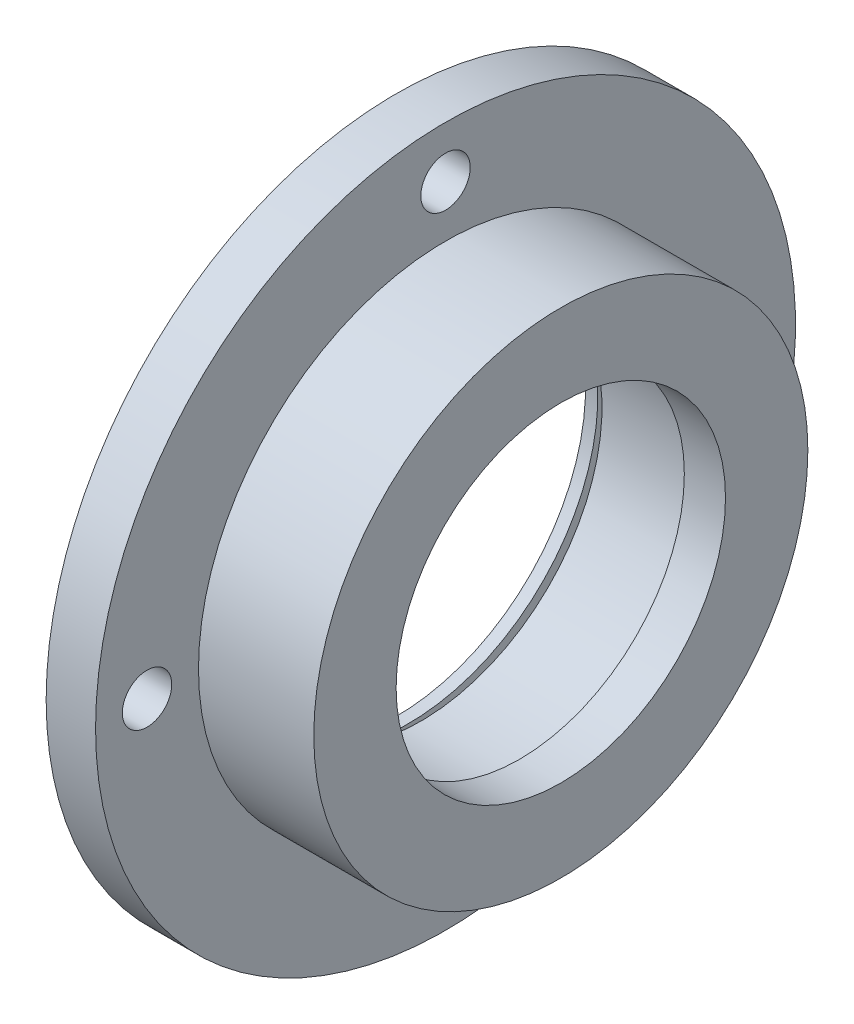
ISO-10303-21;
HEADER;
FILE_DESCRIPTION(('STEP AP214'),'2;1');
FILE_NAME('part.step','',(''),(''),'','','');
FILE_SCHEMA(('AUTOMOTIVE_DESIGN { 1 0 10303 214 1 1 1 1 }'));
ENDSEC;
DATA;
#1=APPLICATION_CONTEXT('core data for automotive mechanical design processes');
#2=APPLICATION_PROTOCOL_DEFINITION('international standard','automotive_design',2000,#1);
#3=PRODUCT_CONTEXT('',#1,'mechanical');
#4=PRODUCT('Part','Part','',(#3));
#5=PRODUCT_RELATED_PRODUCT_CATEGORY('part','',(#4));
#6=PRODUCT_DEFINITION_FORMATION('','',#4);
#7=PRODUCT_DEFINITION_CONTEXT('part definition',#1,'design');
#8=PRODUCT_DEFINITION('design','',#6,#7);
#9=PRODUCT_DEFINITION_SHAPE('','',#8);
#10=(LENGTH_UNIT() NAMED_UNIT(*) SI_UNIT(.MILLI.,.METRE.));
#11=(NAMED_UNIT(*) PLANE_ANGLE_UNIT() SI_UNIT($,.RADIAN.));
#12=(NAMED_UNIT(*) SI_UNIT($,.STERADIAN.) SOLID_ANGLE_UNIT());
#13=UNCERTAINTY_MEASURE_WITH_UNIT(LENGTH_MEASURE(1.E-05),#10,'distance_accuracy_value','');
#14=(GEOMETRIC_REPRESENTATION_CONTEXT(3) GLOBAL_UNCERTAINTY_ASSIGNED_CONTEXT((#13)) GLOBAL_UNIT_ASSIGNED_CONTEXT((#10,
#11,#12)) REPRESENTATION_CONTEXT('',''));
#15=CARTESIAN_POINT('',(0.,0.,0.));
#16=DIRECTION('',(0.,0.,1.));
#17=DIRECTION('',(1.,0.,0.));
#18=AXIS2_PLACEMENT_3D('',#15,#16,#17);
#19=CARTESIAN_POINT('',(0.,0.,0.));
#20=DIRECTION('',(-1.,0.,0.));
#21=DIRECTION('',(0.,0.,1.));
#22=AXIS2_PLACEMENT_3D('',#19,#20,#21);
#23=CYLINDRICAL_SURFACE('',#22,23.);
#24=CARTESIAN_POINT('',(1.49999999999999,0.,0.));
#25=DIRECTION('',(-1.,0.,0.));
#26=DIRECTION('',(0.,0.,1.));
#27=AXIS2_PLACEMENT_3D('',#24,#25,#26);
#28=CIRCLE('',#27,23.);
#29=CARTESIAN_POINT('',(1.49999999999999,0.,23.));
#30=VERTEX_POINT('',#29);
#31=EDGE_CURVE('E84',#30,#30,#28,.T.);
#32=ORIENTED_EDGE('',*,*,#31,.F.);
#33=EDGE_LOOP('',(#32));
#34=FACE_BOUND('',#33,.T.);
#35=CARTESIAN_POINT('',(0.,0.,0.));
#36=DIRECTION('',(-1.,0.,0.));
#37=DIRECTION('',(0.,0.,1.));
#38=AXIS2_PLACEMENT_3D('',#35,#36,#37);
#39=CIRCLE('',#38,23.);
#40=CARTESIAN_POINT('',(0.,0.,23.));
#41=VERTEX_POINT('',#40);
#42=EDGE_CURVE('E12',#41,#41,#39,.T.);
#43=ORIENTED_EDGE('',*,*,#42,.T.);
#44=EDGE_LOOP('',(#43));
#45=FACE_BOUND('',#44,.T.);
#46=ADVANCED_FACE('F44',(#34,#45),#23,.F.);
#47=CARTESIAN_POINT('',(0.,23.,0.));
#48=DIRECTION('',(1.,0.,0.));
#49=DIRECTION('',(0.,0.,-1.));
#50=AXIS2_PLACEMENT_3D('',#47,#48,#49);
#51=PLANE('',#50);
#52=CARTESIAN_POINT('',(0.,0.,36.25));
#53=DIRECTION('',(1.,0.,0.));
#54=DIRECTION('',(0.,0.,-1.));
#55=AXIS2_PLACEMENT_3D('',#52,#53,#54);
#56=CIRCLE('',#55,3.);
#57=CARTESIAN_POINT('',(0.,0.,33.25));
#58=VERTEX_POINT('',#57);
#59=EDGE_CURVE('E103',#58,#58,#56,.T.);
#60=ORIENTED_EDGE('',*,*,#59,.T.);
#61=EDGE_LOOP('',(#60));
#62=FACE_BOUND('',#61,.T.);
#63=CARTESIAN_POINT('',(0.,-36.25,0.));
#64=DIRECTION('',(1.,0.,0.));
#65=DIRECTION('',(0.,0.,-1.));
#66=AXIS2_PLACEMENT_3D('',#63,#64,#65);
#67=CIRCLE('',#66,3.);
#68=CARTESIAN_POINT('',(0.,-36.25,-3.00000000000002));
#69=VERTEX_POINT('',#68);
#70=EDGE_CURVE('E97',#69,#69,#67,.T.);
#71=ORIENTED_EDGE('',*,*,#70,.T.);
#72=EDGE_LOOP('',(#71));
#73=FACE_BOUND('',#72,.T.);
#74=CARTESIAN_POINT('',(0.,0.,-36.25));
#75=DIRECTION('',(1.,0.,0.));
#76=DIRECTION('',(0.,0.,-1.));
#77=AXIS2_PLACEMENT_3D('',#74,#75,#76);
#78=CIRCLE('',#77,3.00000000000015);
#79=CARTESIAN_POINT('',(0.,0.,-39.2500000000002));
#80=VERTEX_POINT('',#79);
#81=EDGE_CURVE('E91',#80,#80,#78,.T.);
#82=ORIENTED_EDGE('',*,*,#81,.T.);
#83=EDGE_LOOP('',(#82));
#84=FACE_BOUND('',#83,.T.);
#85=CARTESIAN_POINT('',(0.,36.25,0.));
#86=DIRECTION('',(1.,0.,0.));
#87=DIRECTION('',(0.,0.,-1.));
#88=AXIS2_PLACEMENT_3D('',#85,#86,#87);
#89=CIRCLE('',#88,3.);
#90=CARTESIAN_POINT('',(0.,36.25,-3.));
#91=VERTEX_POINT('',#90);
#92=EDGE_CURVE('E87',#91,#91,#89,.T.);
#93=ORIENTED_EDGE('',*,*,#92,.T.);
#94=EDGE_LOOP('',(#93));
#95=FACE_BOUND('',#94,.T.);
#96=ORIENTED_EDGE('',*,*,#42,.F.);
#97=EDGE_LOOP('',(#96));
#98=FACE_BOUND('',#97,.T.);
#99=CARTESIAN_POINT('',(0.,0.,0.));
#100=DIRECTION('',(-1.,0.,0.));
#101=DIRECTION('',(0.,0.,1.));
#102=AXIS2_PLACEMENT_3D('',#99,#100,#101);
#103=CIRCLE('',#102,42.5);
#104=CARTESIAN_POINT('',(0.,0.,42.5));
#105=VERTEX_POINT('',#104);
#106=EDGE_CURVE('E50',#105,#105,#103,.T.);
#107=ORIENTED_EDGE('',*,*,#106,.T.);
#108=EDGE_LOOP('',(#107));
#109=FACE_BOUND('',#108,.T.);
#110=ADVANCED_FACE('F112',(#62,#73,#84,#95,#98,#109),#51,.F.);
#111=CARTESIAN_POINT('',(0.,0.,0.));
#112=DIRECTION('',(-1.,0.,0.));
#113=DIRECTION('',(0.,0.,1.));
#114=AXIS2_PLACEMENT_3D('',#111,#112,#113);
#115=CYLINDRICAL_SURFACE('',#114,42.5);
#116=ORIENTED_EDGE('',*,*,#106,.F.);
#117=EDGE_LOOP('',(#116));
#118=FACE_BOUND('',#117,.T.);
#119=CARTESIAN_POINT('',(6.,0.,0.));
#120=DIRECTION('',(-1.,0.,0.));
#121=DIRECTION('',(0.,0.,1.));
#122=AXIS2_PLACEMENT_3D('',#119,#120,#121);
#123=CIRCLE('',#122,42.5);
#124=CARTESIAN_POINT('',(6.,0.,42.5));
#125=VERTEX_POINT('',#124);
#126=EDGE_CURVE('E54',#125,#125,#123,.T.);
#127=ORIENTED_EDGE('',*,*,#126,.T.);
#128=EDGE_LOOP('',(#127));
#129=FACE_BOUND('',#128,.T.);
#130=ADVANCED_FACE('F126',(#118,#129),#115,.T.);
#131=CARTESIAN_POINT('',(6.,42.5,0.));
#132=DIRECTION('',(-1.,0.,0.));
#133=DIRECTION('',(0.,0.,1.));
#134=AXIS2_PLACEMENT_3D('',#131,#132,#133);
#135=PLANE('',#134);
#136=CARTESIAN_POINT('',(6.,0.,36.25));
#137=DIRECTION('',(1.,0.,0.));
#138=DIRECTION('',(0.,0.,-1.));
#139=AXIS2_PLACEMENT_3D('',#136,#137,#138);
#140=CIRCLE('',#139,3.);
#141=CARTESIAN_POINT('',(6.,0.,33.25));
#142=VERTEX_POINT('',#141);
#143=EDGE_CURVE('E106',#142,#142,#140,.T.);
#144=ORIENTED_EDGE('',*,*,#143,.F.);
#145=EDGE_LOOP('',(#144));
#146=FACE_BOUND('',#145,.T.);
#147=CARTESIAN_POINT('',(6.,-36.25,0.));
#148=DIRECTION('',(1.,0.,0.));
#149=DIRECTION('',(0.,0.,-1.));
#150=AXIS2_PLACEMENT_3D('',#147,#148,#149);
#151=CIRCLE('',#150,3.);
#152=CARTESIAN_POINT('',(6.,-36.25,-3.00000000000002));
#153=VERTEX_POINT('',#152);
#154=EDGE_CURVE('E100',#153,#153,#151,.T.);
#155=ORIENTED_EDGE('',*,*,#154,.F.);
#156=EDGE_LOOP('',(#155));
#157=FACE_BOUND('',#156,.T.);
#158=CARTESIAN_POINT('',(6.,0.,-36.25));
#159=DIRECTION('',(1.,0.,0.));
#160=DIRECTION('',(0.,0.,-1.));
#161=AXIS2_PLACEMENT_3D('',#158,#159,#160);
#162=CIRCLE('',#161,3.00000000000015);
#163=CARTESIAN_POINT('',(6.,0.,-39.2500000000002));
#164=VERTEX_POINT('',#163);
#165=EDGE_CURVE('E94',#164,#164,#162,.T.);
#166=ORIENTED_EDGE('',*,*,#165,.F.);
#167=EDGE_LOOP('',(#166));
#168=FACE_BOUND('',#167,.T.);
#169=CARTESIAN_POINT('',(6.,36.25,0.));
#170=DIRECTION('',(1.,0.,0.));
#171=DIRECTION('',(0.,0.,-1.));
#172=AXIS2_PLACEMENT_3D('',#169,#170,#171);
#173=CIRCLE('',#172,3.);
#174=CARTESIAN_POINT('',(6.,36.25,-3.));
#175=VERTEX_POINT('',#174);
#176=EDGE_CURVE('E88',#175,#175,#173,.T.);
#177=ORIENTED_EDGE('',*,*,#176,.F.);
#178=EDGE_LOOP('',(#177));
#179=FACE_BOUND('',#178,.T.);
#180=ORIENTED_EDGE('',*,*,#126,.F.);
#181=EDGE_LOOP('',(#180));
#182=FACE_BOUND('',#181,.T.);
#183=CARTESIAN_POINT('',(5.99999999999999,0.,0.));
#184=DIRECTION('',(-1.,0.,0.));
#185=DIRECTION('',(0.,0.,1.));
#186=AXIS2_PLACEMENT_3D('',#183,#184,#185);
#187=CIRCLE('',#186,30.);
#188=CARTESIAN_POINT('',(5.99999999999999,0.,30.));
#189=VERTEX_POINT('',#188);
#190=EDGE_CURVE('E58',#189,#189,#187,.T.);
#191=ORIENTED_EDGE('',*,*,#190,.T.);
#192=EDGE_LOOP('',(#191));
#193=FACE_BOUND('',#192,.T.);
#194=ADVANCED_FACE('F122',(#146,#157,#168,#179,#182,#193),#135,.F.);
#195=CARTESIAN_POINT('',(0.,0.,0.));
#196=DIRECTION('',(-1.,0.,0.));
#197=DIRECTION('',(0.,0.,1.));
#198=AXIS2_PLACEMENT_3D('',#195,#196,#197);
#199=CYLINDRICAL_SURFACE('',#198,30.);
#200=ORIENTED_EDGE('',*,*,#190,.F.);
#201=EDGE_LOOP('',(#200));
#202=FACE_BOUND('',#201,.T.);
#203=CARTESIAN_POINT('',(20.,0.,0.));
#204=DIRECTION('',(-1.,0.,0.));
#205=DIRECTION('',(0.,0.,1.));
#206=AXIS2_PLACEMENT_3D('',#203,#204,#205);
#207=CIRCLE('',#206,30.);
#208=CARTESIAN_POINT('',(20.,0.,30.));
#209=VERTEX_POINT('',#208);
#210=EDGE_CURVE('E63',#209,#209,#207,.T.);
#211=ORIENTED_EDGE('',*,*,#210,.T.);
#212=EDGE_LOOP('',(#211));
#213=FACE_BOUND('',#212,.T.);
#214=ADVANCED_FACE('F125',(#202,#213),#199,.T.);
#215=CARTESIAN_POINT('',(20.,30.,0.));
#216=DIRECTION('',(-1.,0.,0.));
#217=DIRECTION('',(0.,0.,1.));
#218=AXIS2_PLACEMENT_3D('',#215,#216,#217);
#219=PLANE('',#218);
#220=ORIENTED_EDGE('',*,*,#210,.F.);
#221=EDGE_LOOP('',(#220));
#222=FACE_BOUND('',#221,.T.);
#223=CARTESIAN_POINT('',(20.,0.,0.));
#224=DIRECTION('',(-1.,0.,0.));
#225=DIRECTION('',(0.,0.,1.));
#226=AXIS2_PLACEMENT_3D('',#223,#224,#225);
#227=CIRCLE('',#226,20.);
#228=CARTESIAN_POINT('',(20.,0.,20.));
#229=VERTEX_POINT('',#228);
#230=EDGE_CURVE('E66',#229,#229,#227,.T.);
#231=ORIENTED_EDGE('',*,*,#230,.T.);
#232=EDGE_LOOP('',(#231));
#233=FACE_BOUND('',#232,.T.);
#234=ADVANCED_FACE('F140',(#222,#233),#219,.F.);
#235=CARTESIAN_POINT('',(0.,0.,0.));
#236=DIRECTION('',(-1.,0.,0.));
#237=DIRECTION('',(0.,0.,1.));
#238=AXIS2_PLACEMENT_3D('',#235,#236,#237);
#239=CYLINDRICAL_SURFACE('',#238,20.);
#240=ORIENTED_EDGE('',*,*,#230,.F.);
#241=EDGE_LOOP('',(#240));
#242=FACE_BOUND('',#241,.T.);
#243=CARTESIAN_POINT('',(15.,0.,0.));
#244=DIRECTION('',(-1.,0.,0.));
#245=DIRECTION('',(0.,0.,1.));
#246=AXIS2_PLACEMENT_3D('',#243,#244,#245);
#247=CIRCLE('',#246,20.);
#248=CARTESIAN_POINT('',(15.,0.,20.));
#249=VERTEX_POINT('',#248);
#250=EDGE_CURVE('E69',#249,#249,#247,.T.);
#251=ORIENTED_EDGE('',*,*,#250,.T.);
#252=EDGE_LOOP('',(#251));
#253=FACE_BOUND('',#252,.T.);
#254=ADVANCED_FACE('F146',(#242,#253),#239,.F.);
#255=CARTESIAN_POINT('',(15.,20.,0.));
#256=DIRECTION('',(1.,0.,0.));
#257=DIRECTION('',(0.,0.,-1.));
#258=AXIS2_PLACEMENT_3D('',#255,#256,#257);
#259=PLANE('',#258);
#260=ORIENTED_EDGE('',*,*,#250,.F.);
#261=EDGE_LOOP('',(#260));
#262=FACE_BOUND('',#261,.T.);
#263=CARTESIAN_POINT('',(15.,0.,0.));
#264=DIRECTION('',(-1.,0.,0.));
#265=DIRECTION('',(0.,0.,1.));
#266=AXIS2_PLACEMENT_3D('',#263,#264,#265);
#267=CIRCLE('',#266,22.);
#268=CARTESIAN_POINT('',(15.,0.,22.));
#269=VERTEX_POINT('',#268);
#270=EDGE_CURVE('E72',#269,#269,#267,.T.);
#271=ORIENTED_EDGE('',*,*,#270,.T.);
#272=EDGE_LOOP('',(#271));
#273=FACE_BOUND('',#272,.T.);
#274=ADVANCED_FACE('F152',(#262,#273),#259,.F.);
#275=CARTESIAN_POINT('',(0.,0.,0.));
#276=DIRECTION('',(-1.,0.,0.));
#277=DIRECTION('',(0.,0.,1.));
#278=AXIS2_PLACEMENT_3D('',#275,#276,#277);
#279=CYLINDRICAL_SURFACE('',#278,22.);
#280=ORIENTED_EDGE('',*,*,#270,.F.);
#281=EDGE_LOOP('',(#280));
#282=FACE_BOUND('',#281,.T.);
#283=CARTESIAN_POINT('',(3.,0.,0.));
#284=DIRECTION('',(-1.,0.,0.));
#285=DIRECTION('',(0.,0.,1.));
#286=AXIS2_PLACEMENT_3D('',#283,#284,#285);
#287=CIRCLE('',#286,22.);
#288=CARTESIAN_POINT('',(3.,0.,22.));
#289=VERTEX_POINT('',#288);
#290=EDGE_CURVE('E75',#289,#289,#287,.T.);
#291=ORIENTED_EDGE('',*,*,#290,.T.);
#292=EDGE_LOOP('',(#291));
#293=FACE_BOUND('',#292,.T.);
#294=ADVANCED_FACE('F158',(#282,#293),#279,.F.);
#295=CARTESIAN_POINT('',(3.,22.,0.));
#296=DIRECTION('',(1.,0.,0.));
#297=DIRECTION('',(0.,0.,-1.));
#298=AXIS2_PLACEMENT_3D('',#295,#296,#297);
#299=PLANE('',#298);
#300=ORIENTED_EDGE('',*,*,#290,.F.);
#301=EDGE_LOOP('',(#300));
#302=FACE_BOUND('',#301,.T.);
#303=CARTESIAN_POINT('',(3.,0.,0.));
#304=DIRECTION('',(-1.,0.,0.));
#305=DIRECTION('',(0.,0.,1.));
#306=AXIS2_PLACEMENT_3D('',#303,#304,#305);
#307=CIRCLE('',#306,24.5);
#308=CARTESIAN_POINT('',(3.,0.,24.5));
#309=VERTEX_POINT('',#308);
#310=EDGE_CURVE('E78',#309,#309,#307,.T.);
#311=ORIENTED_EDGE('',*,*,#310,.T.);
#312=EDGE_LOOP('',(#311));
#313=FACE_BOUND('',#312,.T.);
#314=ADVANCED_FACE('F164',(#302,#313),#299,.F.);
#315=CARTESIAN_POINT('',(0.,0.,0.));
#316=DIRECTION('',(-1.,0.,0.));
#317=DIRECTION('',(0.,0.,1.));
#318=AXIS2_PLACEMENT_3D('',#315,#316,#317);
#319=CYLINDRICAL_SURFACE('',#318,24.5);
#320=ORIENTED_EDGE('',*,*,#310,.F.);
#321=EDGE_LOOP('',(#320));
#322=FACE_BOUND('',#321,.T.);
#323=CARTESIAN_POINT('',(1.49999999999999,0.,0.));
#324=DIRECTION('',(-1.,0.,0.));
#325=DIRECTION('',(0.,0.,1.));
#326=AXIS2_PLACEMENT_3D('',#323,#324,#325);
#327=CIRCLE('',#326,24.5);
#328=CARTESIAN_POINT('',(1.49999999999999,0.,24.5));
#329=VERTEX_POINT('',#328);
#330=EDGE_CURVE('E81',#329,#329,#327,.T.);
#331=ORIENTED_EDGE('',*,*,#330,.T.);
#332=EDGE_LOOP('',(#331));
#333=FACE_BOUND('',#332,.T.);
#334=ADVANCED_FACE('F170',(#322,#333),#319,.F.);
#335=CARTESIAN_POINT('',(1.49999999999999,24.5,0.));
#336=DIRECTION('',(-1.,0.,0.));
#337=DIRECTION('',(0.,0.,1.));
#338=AXIS2_PLACEMENT_3D('',#335,#336,#337);
#339=PLANE('',#338);
#340=ORIENTED_EDGE('',*,*,#330,.F.);
#341=EDGE_LOOP('',(#340));
#342=FACE_BOUND('',#341,.T.);
#343=ORIENTED_EDGE('',*,*,#31,.T.);
#344=EDGE_LOOP('',(#343));
#345=FACE_BOUND('',#344,.T.);
#346=ADVANCED_FACE('F176',(#342,#345),#339,.F.);
#347=CARTESIAN_POINT('',(0.,36.25,0.));
#348=DIRECTION('',(1.,0.,0.));
#349=DIRECTION('',(0.,0.,-1.));
#350=AXIS2_PLACEMENT_3D('',#347,#348,#349);
#351=CYLINDRICAL_SURFACE('',#350,3.);
#352=ORIENTED_EDGE('',*,*,#92,.F.);
#353=EDGE_LOOP('',(#352));
#354=FACE_BOUND('',#353,.T.);
#355=ORIENTED_EDGE('',*,*,#176,.T.);
#356=EDGE_LOOP('',(#355));
#357=FACE_BOUND('',#356,.T.);
#358=ADVANCED_FACE('F182',(#354,#357),#351,.F.);
#359=CARTESIAN_POINT('',(0.,0.,-36.25));
#360=DIRECTION('',(1.,0.,0.));
#361=DIRECTION('',(0.,0.,-1.));
#362=AXIS2_PLACEMENT_3D('',#359,#360,#361);
#363=CYLINDRICAL_SURFACE('',#362,3.00000000000015);
#364=ORIENTED_EDGE('',*,*,#81,.F.);
#365=EDGE_LOOP('',(#364));
#366=FACE_BOUND('',#365,.T.);
#367=ORIENTED_EDGE('',*,*,#165,.T.);
#368=EDGE_LOOP('',(#367));
#369=FACE_BOUND('',#368,.T.);
#370=ADVANCED_FACE('F198',(#366,#369),#363,.F.);
#371=CARTESIAN_POINT('',(0.,-36.25,0.));
#372=DIRECTION('',(1.,0.,0.));
#373=DIRECTION('',(0.,0.,-1.));
#374=AXIS2_PLACEMENT_3D('',#371,#372,#373);
#375=CYLINDRICAL_SURFACE('',#374,3.);
#376=ORIENTED_EDGE('',*,*,#70,.F.);
#377=EDGE_LOOP('',(#376));
#378=FACE_BOUND('',#377,.T.);
#379=ORIENTED_EDGE('',*,*,#154,.T.);
#380=EDGE_LOOP('',(#379));
#381=FACE_BOUND('',#380,.T.);
#382=ADVANCED_FACE('F118',(#378,#381),#375,.F.);
#383=CARTESIAN_POINT('',(0.,0.,36.25));
#384=DIRECTION('',(1.,0.,0.));
#385=DIRECTION('',(0.,0.,-1.));
#386=AXIS2_PLACEMENT_3D('',#383,#384,#385);
#387=CYLINDRICAL_SURFACE('',#386,3.);
#388=ORIENTED_EDGE('',*,*,#59,.F.);
#389=EDGE_LOOP('',(#388));
#390=FACE_BOUND('',#389,.T.);
#391=ORIENTED_EDGE('',*,*,#143,.T.);
#392=EDGE_LOOP('',(#391));
#393=FACE_BOUND('',#392,.T.);
#394=ADVANCED_FACE('F115',(#390,#393),#387,.F.);
#395=CLOSED_SHELL('',(#46,#110,#130,#194,#214,#234,#254,#274,#294,#314,#334,#346,#358,#370,#382,#394));
#396=MANIFOLD_SOLID_BREP('B2',#395);
#397=ADVANCED_BREP_SHAPE_REPRESENTATION('',(#18,#396),#14);
#398=SHAPE_DEFINITION_REPRESENTATION(#9,#397);
ENDSEC;
END-ISO-10303-21;
